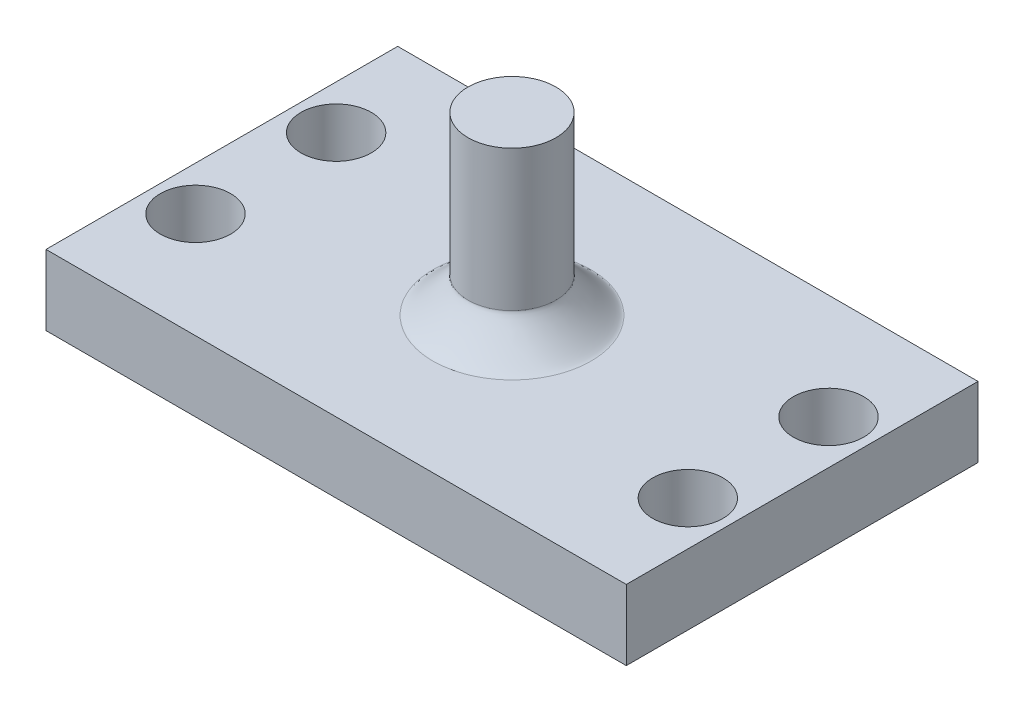
ISO-10303-21;
HEADER;
FILE_DESCRIPTION(('STEP AP214'),'2;1');
FILE_NAME('part.step','',(''),(''),'','','');
FILE_SCHEMA(('AUTOMOTIVE_DESIGN { 1 0 10303 214 1 1 1 1 }'));
ENDSEC;
DATA;
#1=APPLICATION_CONTEXT('core data for automotive mechanical design processes');
#2=APPLICATION_PROTOCOL_DEFINITION('international standard','automotive_design',2000,#1);
#3=PRODUCT_CONTEXT('',#1,'mechanical');
#4=PRODUCT('Part','Part','',(#3));
#5=PRODUCT_RELATED_PRODUCT_CATEGORY('part','',(#4));
#6=PRODUCT_DEFINITION_FORMATION('','',#4);
#7=PRODUCT_DEFINITION_CONTEXT('part definition',#1,'design');
#8=PRODUCT_DEFINITION('design','',#6,#7);
#9=PRODUCT_DEFINITION_SHAPE('','',#8);
#10=(LENGTH_UNIT() NAMED_UNIT(*) SI_UNIT(.MILLI.,.METRE.));
#11=(NAMED_UNIT(*) PLANE_ANGLE_UNIT() SI_UNIT($,.RADIAN.));
#12=(NAMED_UNIT(*) SI_UNIT($,.STERADIAN.) SOLID_ANGLE_UNIT());
#13=UNCERTAINTY_MEASURE_WITH_UNIT(LENGTH_MEASURE(1.E-05),#10,'distance_accuracy_value','');
#14=(GEOMETRIC_REPRESENTATION_CONTEXT(3) GLOBAL_UNCERTAINTY_ASSIGNED_CONTEXT((#13)) GLOBAL_UNIT_ASSIGNED_CONTEXT((#10,
#11,#12)) REPRESENTATION_CONTEXT('',''));
#15=CARTESIAN_POINT('',(0.,0.,0.));
#16=DIRECTION('',(0.,0.,1.));
#17=DIRECTION('',(1.,0.,0.));
#18=AXIS2_PLACEMENT_3D('',#15,#16,#17);
#19=CARTESIAN_POINT('',(-16.5,2.,10.));
#20=DIRECTION('',(1.,0.,0.));
#21=DIRECTION('',(0.,0.,-1.));
#22=AXIS2_PLACEMENT_3D('',#19,#20,#21);
#23=PLANE('',#22);
#24=DIRECTION('',(0.,0.,1.));
#25=VECTOR('',#24,1.);
#26=CARTESIAN_POINT('',(-16.5,-2.,10.));
#27=LINE('',#26,#25);
#28=CARTESIAN_POINT('',(-16.5,-2.,-10.));
#29=VERTEX_POINT('',#28);
#30=CARTESIAN_POINT('',(-16.5,-2.,10.));
#31=VERTEX_POINT('',#30);
#32=EDGE_CURVE('E111',#29,#31,#27,.T.);
#33=ORIENTED_EDGE('',*,*,#32,.T.);
#34=DIRECTION('',(0.,-1.,0.));
#35=VECTOR('',#34,1.);
#36=CARTESIAN_POINT('',(-16.5,2.,10.));
#37=LINE('',#36,#35);
#38=CARTESIAN_POINT('',(-16.5,2.,10.));
#39=VERTEX_POINT('',#38);
#40=EDGE_CURVE('E102',#39,#31,#37,.T.);
#41=ORIENTED_EDGE('',*,*,#40,.F.);
#42=DIRECTION('',(0.,0.,1.));
#43=VECTOR('',#42,1.);
#44=CARTESIAN_POINT('',(-16.5,2.,10.));
#45=LINE('',#44,#43);
#46=CARTESIAN_POINT('',(-16.5,2.,-10.));
#47=VERTEX_POINT('',#46);
#48=EDGE_CURVE('E96',#47,#39,#45,.T.);
#49=ORIENTED_EDGE('',*,*,#48,.F.);
#50=DIRECTION('',(0.,-1.,0.));
#51=VECTOR('',#50,1.);
#52=CARTESIAN_POINT('',(-16.5,2.,-10.));
#53=LINE('',#52,#51);
#54=EDGE_CURVE('E107',#47,#29,#53,.T.);
#55=ORIENTED_EDGE('',*,*,#54,.T.);
#56=EDGE_LOOP('',(#33,#41,#49,#55));
#57=FACE_BOUND('',#56,.T.);
#58=ADVANCED_FACE('F37',(#57),#23,.F.);
#59=CARTESIAN_POINT('',(16.5,2.,10.));
#60=DIRECTION('',(0.,0.,-1.));
#61=DIRECTION('',(-1.,0.,0.));
#62=AXIS2_PLACEMENT_3D('',#59,#60,#61);
#63=PLANE('',#62);
#64=DIRECTION('',(1.,0.,0.));
#65=VECTOR('',#64,1.);
#66=CARTESIAN_POINT('',(16.5,-2.,10.));
#67=LINE('',#66,#65);
#68=CARTESIAN_POINT('',(16.5,-2.,10.));
#69=VERTEX_POINT('',#68);
#70=EDGE_CURVE('E101',#31,#69,#67,.T.);
#71=ORIENTED_EDGE('',*,*,#70,.T.);
#72=DIRECTION('',(0.,-1.,0.));
#73=VECTOR('',#72,1.);
#74=CARTESIAN_POINT('',(16.5,2.,10.));
#75=LINE('',#74,#73);
#76=CARTESIAN_POINT('',(16.5,2.,10.));
#77=VERTEX_POINT('',#76);
#78=EDGE_CURVE('E99',#77,#69,#75,.T.);
#79=ORIENTED_EDGE('',*,*,#78,.F.);
#80=DIRECTION('',(1.,0.,0.));
#81=VECTOR('',#80,1.);
#82=CARTESIAN_POINT('',(16.5,2.,10.));
#83=LINE('',#82,#81);
#84=EDGE_CURVE('E91',#39,#77,#83,.T.);
#85=ORIENTED_EDGE('',*,*,#84,.F.);
#86=ORIENTED_EDGE('',*,*,#40,.T.);
#87=EDGE_LOOP('',(#71,#79,#85,#86));
#88=FACE_BOUND('',#87,.T.);
#89=ADVANCED_FACE('F100',(#88),#63,.F.);
#90=CARTESIAN_POINT('',(16.5,2.,10.));
#91=DIRECTION('',(-1.,0.,0.));
#92=DIRECTION('',(0.,0.,1.));
#93=AXIS2_PLACEMENT_3D('',#90,#91,#92);
#94=PLANE('',#93);
#95=DIRECTION('',(0.,0.,-1.));
#96=VECTOR('',#95,1.);
#97=CARTESIAN_POINT('',(16.5,-2.,10.));
#98=LINE('',#97,#96);
#99=CARTESIAN_POINT('',(16.5,-2.,-10.));
#100=VERTEX_POINT('',#99);
#101=EDGE_CURVE('E77',#69,#100,#98,.T.);
#102=ORIENTED_EDGE('',*,*,#101,.T.);
#103=DIRECTION('',(0.,-1.,0.));
#104=VECTOR('',#103,1.);
#105=CARTESIAN_POINT('',(16.5,2.,-10.));
#106=LINE('',#105,#104);
#107=CARTESIAN_POINT('',(16.5,2.,-10.));
#108=VERTEX_POINT('',#107);
#109=EDGE_CURVE('E103',#108,#100,#106,.T.);
#110=ORIENTED_EDGE('',*,*,#109,.F.);
#111=DIRECTION('',(0.,0.,-1.));
#112=VECTOR('',#111,1.);
#113=CARTESIAN_POINT('',(16.5,2.,10.));
#114=LINE('',#113,#112);
#115=EDGE_CURVE('E94',#77,#108,#114,.T.);
#116=ORIENTED_EDGE('',*,*,#115,.F.);
#117=ORIENTED_EDGE('',*,*,#78,.T.);
#118=EDGE_LOOP('',(#102,#110,#116,#117));
#119=FACE_BOUND('',#118,.T.);
#120=ADVANCED_FACE('F105',(#119),#94,.F.);
#121=CARTESIAN_POINT('',(16.5,2.,-10.));
#122=DIRECTION('',(0.,0.,1.));
#123=DIRECTION('',(1.,0.,0.));
#124=AXIS2_PLACEMENT_3D('',#121,#122,#123);
#125=PLANE('',#124);
#126=DIRECTION('',(-1.,0.,0.));
#127=VECTOR('',#126,1.);
#128=CARTESIAN_POINT('',(16.5,-2.,-10.));
#129=LINE('',#128,#127);
#130=EDGE_CURVE('E83',#100,#29,#129,.T.);
#131=ORIENTED_EDGE('',*,*,#130,.T.);
#132=ORIENTED_EDGE('',*,*,#54,.F.);
#133=DIRECTION('',(-1.,0.,0.));
#134=VECTOR('',#133,1.);
#135=CARTESIAN_POINT('',(16.5,2.,-10.));
#136=LINE('',#135,#134);
#137=EDGE_CURVE('E60',#108,#47,#136,.T.);
#138=ORIENTED_EDGE('',*,*,#137,.F.);
#139=ORIENTED_EDGE('',*,*,#109,.T.);
#140=EDGE_LOOP('',(#131,#132,#138,#139));
#141=FACE_BOUND('',#140,.T.);
#142=ADVANCED_FACE('F161',(#141),#125,.F.);
#143=CARTESIAN_POINT('',(0.,2.,0.));
#144=DIRECTION('',(0.,1.,0.));
#145=DIRECTION('',(0.,0.,1.));
#146=AXIS2_PLACEMENT_3D('',#143,#144,#145);
#147=PLANE('',#146);
#148=CARTESIAN_POINT('',(0.,2.,4.5));
#149=CARTESIAN_POINT('',(0.58904861769985,2.,4.5));
#150=CARTESIAN_POINT('',(1.17786548409582,2.,4.38287704315228));
#151=CARTESIAN_POINT('',(2.26628540718998,2.,3.9320387494493));
#152=CARTESIAN_POINT('',(2.7654602433153,2.,3.59850078736363));
#153=CARTESIAN_POINT('',(3.59850078736363,2.,2.7654602433153));
#154=CARTESIAN_POINT('',(3.9320387494497,2.,2.26628540718993));
#155=CARTESIAN_POINT('',(4.38287704315188,2.,1.17786548409587));
#156=CARTESIAN_POINT('',(4.5,2.,0.58904861769995));
#157=CARTESIAN_POINT('',(4.5,2.,-0.589048617699949));
#158=CARTESIAN_POINT('',(4.38287704315213,2.,-1.17786548409594));
#159=CARTESIAN_POINT('',(3.93203874944945,2.,-2.26628540718987));
#160=CARTESIAN_POINT('',(3.5985007873638,2.,-2.76546024331526));
#161=CARTESIAN_POINT('',(2.76546024331512,2.,-3.59850078736368));
#162=CARTESIAN_POINT('',(2.26628540718997,2.,-3.93203874944941));
#163=CARTESIAN_POINT('',(1.17786548409585,2.,-4.38287704315216));
#164=CARTESIAN_POINT('',(0.58904861769995,2.,-4.5));
#165=CARTESIAN_POINT('',(-0.589048617699949,2.,-4.5));
#166=CARTESIAN_POINT('',(-1.17786548409583,2.,-4.38287704315217));
#167=CARTESIAN_POINT('',(-2.26628540718996,2.,-3.93203874944942));
#168=CARTESIAN_POINT('',(-2.76546024331538,2.,-3.59850078736367));
#169=CARTESIAN_POINT('',(-3.59850078736355,2.,-2.76546024331525));
#170=CARTESIAN_POINT('',(-3.93203874944947,2.,-2.26628540718997));
#171=CARTESIAN_POINT('',(-4.3828770431521,2.,-1.17786548409584));
#172=CARTESIAN_POINT('',(-4.5,2.,-0.589048617699943));
#173=CARTESIAN_POINT('',(-4.5,2.,0.589048617699958));
#174=CARTESIAN_POINT('',(-4.38287704315211,2.,1.17786548409583));
#175=CARTESIAN_POINT('',(-3.93203874944948,2.,2.26628540718996));
#176=CARTESIAN_POINT('',(-3.59850078736362,2.,2.76546024331518));
#177=CARTESIAN_POINT('',(-2.76546024331532,2.,3.59850078736373));
#178=CARTESIAN_POINT('',(-2.26628540719004,2.,3.93203874944947));
#179=CARTESIAN_POINT('',(-1.17786548409578,2.,4.3828770431521));
#180=CARTESIAN_POINT('',(-0.58904861769985,2.,4.5));
#181=CARTESIAN_POINT('',(0.,2.,4.5));
#182=(BOUNDED_CURVE() B_SPLINE_CURVE(3,(#148,#149,#150,#151,#152,#153,#154,#155,#156,#157,#158,
#159,#160,#161,#162,#163,#164,#165,#166,#167,#168,#169,#170,#171,#172,#173,#174,#175,#176,#177,
#178,#179,#180,#181),.UNSPECIFIED.,.T.,.F.) B_SPLINE_CURVE_WITH_KNOTS((4,2,2,2,2,2,2,2,2,2,2,2,
2,2,2,2,4),(0.,0.392699081698724,0.785398163397448,1.17809724509617,1.5707963267949,
1.96349540849362,2.35619449019234,2.74889357189107,3.14159265358979,3.53429173528852,
3.92699081698724,4.31968989868597,4.71238898038469,5.10508806208341,5.49778714378214,
5.89048622548086,6.28318530717959),
.UNSPECIFIED.) CURVE() GEOMETRIC_REPRESENTATION_ITEM() RATIONAL_B_SPLINE_CURVE((1.,1.,1.,1.,1.,
1.,1.,1.,1.,1.,1.,1.,1.,1.,1.,1.,1.,1.,1.,1.,1.,1.,1.,1.,1.,1.,1.,1.,1.,1.,1.,1.,1.,1.)) REPRESENTATION_ITEM(''));
#183=CARTESIAN_POINT('',(0.,2.,4.5));
#184=VERTEX_POINT('',#183);
#185=EDGE_CURVE('E12',#184,#184,#182,.F.);
#186=ORIENTED_EDGE('',*,*,#185,.T.);
#187=EDGE_LOOP('',(#186));
#188=FACE_BOUND('',#187,.T.);
#189=CARTESIAN_POINT('',(14.,2.,-4.));
#190=DIRECTION('',(0.,1.,0.));
#191=DIRECTION('',(0.,0.,-1.));
#192=AXIS2_PLACEMENT_3D('',#189,#190,#191);
#193=CIRCLE('',#192,2.);
#194=CARTESIAN_POINT('',(14.,2.,-6.));
#195=VERTEX_POINT('',#194);
#196=EDGE_CURVE('E187',#195,#195,#193,.T.);
#197=ORIENTED_EDGE('',*,*,#196,.F.);
#198=EDGE_LOOP('',(#197));
#199=FACE_BOUND('',#198,.T.);
#200=CARTESIAN_POINT('',(14.,2.,4.));
#201=DIRECTION('',(0.,1.,0.));
#202=DIRECTION('',(0.,0.,-1.));
#203=AXIS2_PLACEMENT_3D('',#200,#201,#202);
#204=CIRCLE('',#203,2.);
#205=CARTESIAN_POINT('',(14.,2.,2.));
#206=VERTEX_POINT('',#205);
#207=EDGE_CURVE('E191',#206,#206,#204,.T.);
#208=ORIENTED_EDGE('',*,*,#207,.F.);
#209=EDGE_LOOP('',(#208));
#210=FACE_BOUND('',#209,.T.);
#211=CARTESIAN_POINT('',(-14.,2.,4.));
#212=DIRECTION('',(0.,1.,0.));
#213=DIRECTION('',(0.,0.,1.));
#214=AXIS2_PLACEMENT_3D('',#211,#212,#213);
#215=CIRCLE('',#214,2.);
#216=CARTESIAN_POINT('',(-14.,2.,6.));
#217=VERTEX_POINT('',#216);
#218=EDGE_CURVE('E195',#217,#217,#215,.T.);
#219=ORIENTED_EDGE('',*,*,#218,.F.);
#220=EDGE_LOOP('',(#219));
#221=FACE_BOUND('',#220,.T.);
#222=CARTESIAN_POINT('',(-14.,2.,-4.));
#223=DIRECTION('',(0.,1.,0.));
#224=DIRECTION('',(0.,0.,1.));
#225=AXIS2_PLACEMENT_3D('',#222,#223,#224);
#226=CIRCLE('',#225,2.);
#227=CARTESIAN_POINT('',(-14.,2.,-2.));
#228=VERTEX_POINT('',#227);
#229=EDGE_CURVE('E198',#228,#228,#226,.T.);
#230=ORIENTED_EDGE('',*,*,#229,.F.);
#231=EDGE_LOOP('',(#230));
#232=FACE_BOUND('',#231,.T.);
#233=ORIENTED_EDGE('',*,*,#48,.T.);
#234=ORIENTED_EDGE('',*,*,#84,.T.);
#235=ORIENTED_EDGE('',*,*,#115,.T.);
#236=ORIENTED_EDGE('',*,*,#137,.T.);
#237=EDGE_LOOP('',(#233,#234,#235,#236));
#238=FACE_BOUND('',#237,.T.);
#239=ADVANCED_FACE('F92',(#188,#199,#210,#221,#232,#238),#147,.T.);
#240=CARTESIAN_POINT('',(0.,-2.,0.));
#241=DIRECTION('',(0.,1.,0.));
#242=DIRECTION('',(0.,0.,1.));
#243=AXIS2_PLACEMENT_3D('',#240,#241,#242);
#244=PLANE('',#243);
#245=CARTESIAN_POINT('',(14.,-2.,-4.));
#246=DIRECTION('',(0.,1.,0.));
#247=DIRECTION('',(0.,0.,-1.));
#248=AXIS2_PLACEMENT_3D('',#245,#246,#247);
#249=CIRCLE('',#248,2.);
#250=CARTESIAN_POINT('',(14.,-2.,-6.));
#251=VERTEX_POINT('',#250);
#252=EDGE_CURVE('E208',#251,#251,#249,.T.);
#253=ORIENTED_EDGE('',*,*,#252,.T.);
#254=EDGE_LOOP('',(#253));
#255=FACE_BOUND('',#254,.T.);
#256=CARTESIAN_POINT('',(14.,-2.,4.));
#257=DIRECTION('',(0.,1.,0.));
#258=DIRECTION('',(0.,0.,-1.));
#259=AXIS2_PLACEMENT_3D('',#256,#257,#258);
#260=CIRCLE('',#259,2.);
#261=CARTESIAN_POINT('',(14.,-2.,2.));
#262=VERTEX_POINT('',#261);
#263=EDGE_CURVE('E213',#262,#262,#260,.T.);
#264=ORIENTED_EDGE('',*,*,#263,.T.);
#265=EDGE_LOOP('',(#264));
#266=FACE_BOUND('',#265,.T.);
#267=CARTESIAN_POINT('',(-14.,-2.,4.));
#268=DIRECTION('',(0.,1.,0.));
#269=DIRECTION('',(0.,0.,1.));
#270=AXIS2_PLACEMENT_3D('',#267,#268,#269);
#271=CIRCLE('',#270,2.);
#272=CARTESIAN_POINT('',(-14.,-2.,6.));
#273=VERTEX_POINT('',#272);
#274=EDGE_CURVE('E200',#273,#273,#271,.T.);
#275=ORIENTED_EDGE('',*,*,#274,.T.);
#276=EDGE_LOOP('',(#275));
#277=FACE_BOUND('',#276,.T.);
#278=CARTESIAN_POINT('',(-14.,-2.,-4.));
#279=DIRECTION('',(0.,1.,0.));
#280=DIRECTION('',(0.,0.,1.));
#281=AXIS2_PLACEMENT_3D('',#278,#279,#280);
#282=CIRCLE('',#281,2.);
#283=CARTESIAN_POINT('',(-14.,-2.,-2.));
#284=VERTEX_POINT('',#283);
#285=EDGE_CURVE('E114',#284,#284,#282,.T.);
#286=ORIENTED_EDGE('',*,*,#285,.T.);
#287=EDGE_LOOP('',(#286));
#288=FACE_BOUND('',#287,.T.);
#289=ORIENTED_EDGE('',*,*,#32,.F.);
#290=ORIENTED_EDGE('',*,*,#130,.F.);
#291=ORIENTED_EDGE('',*,*,#101,.F.);
#292=ORIENTED_EDGE('',*,*,#70,.F.);
#293=EDGE_LOOP('',(#289,#290,#291,#292));
#294=FACE_BOUND('',#293,.T.);
#295=ADVANCED_FACE('F156',(#255,#266,#277,#288,#294),#244,.F.);
#296=CARTESIAN_POINT('',(-14.,-2.,-4.));
#297=DIRECTION('',(0.,1.,0.));
#298=DIRECTION('',(0.,0.,1.));
#299=AXIS2_PLACEMENT_3D('',#296,#297,#298);
#300=CYLINDRICAL_SURFACE('',#299,2.);
#301=ORIENTED_EDGE('',*,*,#285,.F.);
#302=EDGE_LOOP('',(#301));
#303=FACE_BOUND('',#302,.T.);
#304=ORIENTED_EDGE('',*,*,#229,.T.);
#305=EDGE_LOOP('',(#304));
#306=FACE_BOUND('',#305,.T.);
#307=ADVANCED_FACE('F146',(#303,#306),#300,.F.);
#308=CARTESIAN_POINT('',(-14.,-2.,4.));
#309=DIRECTION('',(0.,1.,0.));
#310=DIRECTION('',(0.,0.,1.));
#311=AXIS2_PLACEMENT_3D('',#308,#309,#310);
#312=CYLINDRICAL_SURFACE('',#311,2.);
#313=ORIENTED_EDGE('',*,*,#274,.F.);
#314=EDGE_LOOP('',(#313));
#315=FACE_BOUND('',#314,.T.);
#316=ORIENTED_EDGE('',*,*,#218,.T.);
#317=EDGE_LOOP('',(#316));
#318=FACE_BOUND('',#317,.T.);
#319=ADVANCED_FACE('F142',(#315,#318),#312,.F.);
#320=CARTESIAN_POINT('',(14.,-2.,4.));
#321=DIRECTION('',(0.,1.,0.));
#322=DIRECTION('',(0.,0.,1.));
#323=AXIS2_PLACEMENT_3D('',#320,#321,#322);
#324=CYLINDRICAL_SURFACE('',#323,2.);
#325=ORIENTED_EDGE('',*,*,#263,.F.);
#326=EDGE_LOOP('',(#325));
#327=FACE_BOUND('',#326,.T.);
#328=ORIENTED_EDGE('',*,*,#207,.T.);
#329=EDGE_LOOP('',(#328));
#330=FACE_BOUND('',#329,.T.);
#331=ADVANCED_FACE('F145',(#327,#330),#324,.F.);
#332=CARTESIAN_POINT('',(14.,-2.,-4.));
#333=DIRECTION('',(0.,1.,0.));
#334=DIRECTION('',(0.,0.,1.));
#335=AXIS2_PLACEMENT_3D('',#332,#333,#334);
#336=CYLINDRICAL_SURFACE('',#335,2.);
#337=ORIENTED_EDGE('',*,*,#252,.F.);
#338=EDGE_LOOP('',(#337));
#339=FACE_BOUND('',#338,.T.);
#340=ORIENTED_EDGE('',*,*,#196,.T.);
#341=EDGE_LOOP('',(#340));
#342=FACE_BOUND('',#341,.T.);
#343=ADVANCED_FACE('F141',(#339,#342),#336,.F.);
#344=CARTESIAN_POINT('',(0.,12.,0.));
#345=DIRECTION('',(0.,-1.,0.));
#346=DIRECTION('',(0.,0.,-1.));
#347=AXIS2_PLACEMENT_3D('',#344,#345,#346);
#348=CYLINDRICAL_SURFACE('',#347,2.5);
#349=CARTESIAN_POINT('',(0.,4.,2.5));
#350=CARTESIAN_POINT('',(-0.327249232055472,4.,2.5));
#351=CARTESIAN_POINT('',(-0.654369713386536,4.,2.43493169064009));
#352=CARTESIAN_POINT('',(-1.25904744843892,4.,2.18446597191634));
#353=CARTESIAN_POINT('',(-1.5363668018418,4.,1.99916710409094));
#354=CARTESIAN_POINT('',(-1.99916710409095,4.,1.53636680184179));
#355=CARTESIAN_POINT('',(-2.18446597191637,4.,1.25904744843886));
#356=CARTESIAN_POINT('',(-2.43493169064007,4.,0.654369713386583));
#357=CARTESIAN_POINT('',(-2.5,4.,0.327249232055532));
#358=CARTESIAN_POINT('',(-2.5,4.,-0.327249232055524));
#359=CARTESIAN_POINT('',(-2.43493169064007,4.,-0.654369713386591));
#360=CARTESIAN_POINT('',(-2.18446597191637,4.,-1.25904744843886));
#361=CARTESIAN_POINT('',(-1.99916710409093,4.,-1.53636680184181));
#362=CARTESIAN_POINT('',(-1.53636680184181,4.,-1.99916710409093));
#363=CARTESIAN_POINT('',(-1.25904744843886,4.,-2.18446597191637));
#364=CARTESIAN_POINT('',(-0.65436971338658,4.,-2.43493169064007));
#365=CARTESIAN_POINT('',(-0.327249232055527,4.,-2.5));
#366=CARTESIAN_POINT('',(0.327249232055528,4.,-2.5));
#367=CARTESIAN_POINT('',(0.654369713386587,4.,-2.43493169064007));
#368=CARTESIAN_POINT('',(1.25904744843887,4.,-2.18446597191637));
#369=CARTESIAN_POINT('',(1.53636680184174,4.,-1.999167104091));
#370=CARTESIAN_POINT('',(1.99916710409099,4.,-1.53636680184174));
#371=CARTESIAN_POINT('',(2.1844659719164,4.,-1.2590474484388));
#372=CARTESIAN_POINT('',(2.43493169064004,4.,-0.654369713386654));
#373=CARTESIAN_POINT('',(2.5,4.,-0.327249232055527));
#374=CARTESIAN_POINT('',(2.5,4.,0.327249232055528));
#375=CARTESIAN_POINT('',(2.43493169064005,4.,0.654369713386634));
#376=CARTESIAN_POINT('',(2.18446597191639,4.,1.25904744843881));
#377=CARTESIAN_POINT('',(1.99916710409092,4.,1.53636680184182));
#378=CARTESIAN_POINT('',(1.53636680184182,4.,1.99916710409092));
#379=CARTESIAN_POINT('',(1.25904744843891,4.,2.18446597191635));
#380=CARTESIAN_POINT('',(0.654369713386541,4.,2.43493169064008));
#381=CARTESIAN_POINT('',(0.327249232055472,4.,2.5));
#382=CARTESIAN_POINT('',(0.,4.,2.5));
#383=(BOUNDED_CURVE() B_SPLINE_CURVE(3,(#349,#350,#351,#352,#353,#354,#355,#356,#357,#358,#359,
#360,#361,#362,#363,#364,#365,#366,#367,#368,#369,#370,#371,#372,#373,#374,#375,#376,#377,#378,
#379,#380,#381,#382),.UNSPECIFIED.,.T.,.F.) B_SPLINE_CURVE_WITH_KNOTS((4,2,2,2,2,2,2,2,2,2,2,2,
2,2,2,2,4),(0.,0.392699081698725,0.785398163397448,1.17809724509617,1.5707963267949,
1.96349540849362,2.35619449019234,2.74889357189107,3.14159265358979,3.53429173528852,
3.92699081698724,4.31968989868597,4.71238898038469,5.10508806208341,5.49778714378214,
5.89048622548086,6.28318530717959),
.UNSPECIFIED.) CURVE() GEOMETRIC_REPRESENTATION_ITEM() RATIONAL_B_SPLINE_CURVE((1.,1.,1.,1.,1.,
1.,1.,1.,1.,1.,1.,1.,1.,1.,1.,1.,1.,1.,1.,1.,1.,1.,1.,1.,1.,1.,1.,1.,1.,1.,1.,1.,1.,1.)) REPRESENTATION_ITEM(''));
#384=CARTESIAN_POINT('',(0.,4.,2.5));
#385=VERTEX_POINT('',#384);
#386=EDGE_CURVE('E52',#385,#385,#383,.F.);
#387=ORIENTED_EDGE('',*,*,#386,.T.);
#388=EDGE_LOOP('',(#387));
#389=FACE_BOUND('',#388,.T.);
#390=CARTESIAN_POINT('',(0.,12.,0.));
#391=DIRECTION('',(0.,1.,0.));
#392=DIRECTION('',(0.,0.,1.));
#393=AXIS2_PLACEMENT_3D('',#390,#391,#392);
#394=CIRCLE('',#393,2.5);
#395=CARTESIAN_POINT('',(0.,12.,2.5));
#396=VERTEX_POINT('',#395);
#397=EDGE_CURVE('E209',#396,#396,#394,.T.);
#398=ORIENTED_EDGE('',*,*,#397,.F.);
#399=EDGE_LOOP('',(#398));
#400=FACE_BOUND('',#399,.T.);
#401=ADVANCED_FACE('F130',(#389,#400),#348,.T.);
#402=CARTESIAN_POINT('',(0.,12.,0.));
#403=DIRECTION('',(0.,1.,0.));
#404=DIRECTION('',(0.,0.,1.));
#405=AXIS2_PLACEMENT_3D('',#402,#403,#404);
#406=PLANE('',#405);
#407=ORIENTED_EDGE('',*,*,#397,.T.);
#408=EDGE_LOOP('',(#407));
#409=FACE_BOUND('',#408,.T.);
#410=ADVANCED_FACE('F140',(#409),#406,.T.);
#411=CARTESIAN_POINT('',(0.,4.,2.5));
#412=CARTESIAN_POINT('',(0.327249232055472,4.,2.5));
#413=CARTESIAN_POINT('',(0.654369713386541,4.,2.43493169064008));
#414=CARTESIAN_POINT('',(1.25904744843891,4.,2.18446597191635));
#415=CARTESIAN_POINT('',(1.53636680184182,4.,1.99916710409092));
#416=CARTESIAN_POINT('',(1.99916710409092,4.,1.53636680184182));
#417=CARTESIAN_POINT('',(2.18446597191639,4.,1.25904744843881));
#418=CARTESIAN_POINT('',(2.43493169064005,4.,0.654369713386634));
#419=CARTESIAN_POINT('',(2.5,4.,0.327249232055528));
#420=CARTESIAN_POINT('',(2.5,4.,-0.327249232055527));
#421=CARTESIAN_POINT('',(2.43493169064004,4.,-0.654369713386654));
#422=CARTESIAN_POINT('',(2.1844659719164,4.,-1.2590474484388));
#423=CARTESIAN_POINT('',(1.99916710409099,4.,-1.53636680184174));
#424=CARTESIAN_POINT('',(1.53636680184174,4.,-1.999167104091));
#425=CARTESIAN_POINT('',(1.25904744843887,4.,-2.18446597191637));
#426=CARTESIAN_POINT('',(0.654369713386587,4.,-2.43493169064007));
#427=CARTESIAN_POINT('',(0.327249232055528,4.,-2.5));
#428=CARTESIAN_POINT('',(-0.327249232055527,4.,-2.5));
#429=CARTESIAN_POINT('',(-0.65436971338658,4.,-2.43493169064007));
#430=CARTESIAN_POINT('',(-1.25904744843886,4.,-2.18446597191637));
#431=CARTESIAN_POINT('',(-1.53636680184181,4.,-1.99916710409093));
#432=CARTESIAN_POINT('',(-1.99916710409093,4.,-1.53636680184181));
#433=CARTESIAN_POINT('',(-2.18446597191637,4.,-1.25904744843886));
#434=CARTESIAN_POINT('',(-2.43493169064007,4.,-0.654369713386591));
#435=CARTESIAN_POINT('',(-2.5,4.,-0.327249232055524));
#436=CARTESIAN_POINT('',(-2.5,4.,0.327249232055532));
#437=CARTESIAN_POINT('',(-2.43493169064007,4.,0.654369713386583));
#438=CARTESIAN_POINT('',(-2.18446597191637,4.,1.25904744843886));
#439=CARTESIAN_POINT('',(-1.99916710409095,4.,1.53636680184179));
#440=CARTESIAN_POINT('',(-1.5363668018418,4.,1.99916710409094));
#441=CARTESIAN_POINT('',(-1.25904744843892,4.,2.18446597191634));
#442=CARTESIAN_POINT('',(-0.654369713386536,4.,2.43493169064009));
#443=CARTESIAN_POINT('',(-0.327249232055472,4.,2.5));
#444=CARTESIAN_POINT('',(0.,4.,2.5));
#445=CARTESIAN_POINT('',(0.,2.,2.5));
#446=CARTESIAN_POINT('',(0.327249232055472,2.,2.5));
#447=CARTESIAN_POINT('',(0.654369713386495,2.,2.43493169064013));
#448=CARTESIAN_POINT('',(1.25904744843895,2.,2.18446597191631));
#449=CARTESIAN_POINT('',(1.53636680184163,2.,1.99916710409111));
#450=CARTESIAN_POINT('',(1.99916710409111,2.,1.53636680184163));
#451=CARTESIAN_POINT('',(2.18446597191676,2.,1.25904744843894));
#452=CARTESIAN_POINT('',(2.43493169063968,2.,0.654369713386502));
#453=CARTESIAN_POINT('',(2.5,2.,0.327249232055528));
#454=CARTESIAN_POINT('',(2.5,2.,-0.327249232055527));
#455=CARTESIAN_POINT('',(2.43493169063993,2.,-0.654369713386696));
#456=CARTESIAN_POINT('',(2.1844659719165,2.,-1.25904744843876));
#457=CARTESIAN_POINT('',(1.99916710409099,2.00000000000013,-1.53636680184187));
#458=CARTESIAN_POINT('',(1.53636680184174,1.99999999999987,-1.99916710409087));
#459=CARTESIAN_POINT('',(1.25904744843897,2.,-2.1844659719165));
#460=CARTESIAN_POINT('',(0.654369713386489,2.,-2.43493169063994));
#461=CARTESIAN_POINT('',(0.327249232055528,2.,-2.5));
#462=CARTESIAN_POINT('',(-0.327249232055527,2.,-2.5));
#463=CARTESIAN_POINT('',(-0.65436971338661,2.,-2.43493169064019));
#464=CARTESIAN_POINT('',(-1.25904744843883,2.,-2.18446597191624));
#465=CARTESIAN_POINT('',(-1.53636680184181,2.,-1.99916710409093));
#466=CARTESIAN_POINT('',(-1.99916710409093,2.,-1.53636680184181));
#467=CARTESIAN_POINT('',(-2.1844659719165,2.,-1.25904744843887));
#468=CARTESIAN_POINT('',(-2.43493169063993,2.,-0.654369713386587));
#469=CARTESIAN_POINT('',(-2.5,2.,-0.327249232055524));
#470=CARTESIAN_POINT('',(-2.5,2.,0.327249232055532));
#471=CARTESIAN_POINT('',(-2.43493169064006,2.,0.654369713386676));
#472=CARTESIAN_POINT('',(-2.18446597191638,2.,1.25904744843877));
#473=CARTESIAN_POINT('',(-1.99916710409102,2.,1.53636680184179));
#474=CARTESIAN_POINT('',(-1.53636680184173,2.,1.99916710409094));
#475=CARTESIAN_POINT('',(-1.259047448439,2.,2.1844659719165));
#476=CARTESIAN_POINT('',(-0.65436971338646,2.,2.43493169063993));
#477=CARTESIAN_POINT('',(-0.327249232055472,2.,2.5));
#478=CARTESIAN_POINT('',(0.,2.,2.5));
#479=CARTESIAN_POINT('',(0.,2.,4.5));
#480=CARTESIAN_POINT('',(0.58904861769985,2.,4.5));
#481=CARTESIAN_POINT('',(1.17786548409582,2.,4.38287704315228));
#482=CARTESIAN_POINT('',(2.26628540718998,2.,3.9320387494493));
#483=CARTESIAN_POINT('',(2.7654602433153,2.,3.59850078736363));
#484=CARTESIAN_POINT('',(3.59850078736363,2.,2.7654602433153));
#485=CARTESIAN_POINT('',(3.9320387494497,2.,2.26628540718993));
#486=CARTESIAN_POINT('',(4.38287704315188,2.,1.17786548409587));
#487=CARTESIAN_POINT('',(4.5,2.,0.58904861769995));
#488=CARTESIAN_POINT('',(4.5,2.,-0.589048617699949));
#489=CARTESIAN_POINT('',(4.38287704315213,2.,-1.17786548409594));
#490=CARTESIAN_POINT('',(3.93203874944945,2.,-2.26628540718987));
#491=CARTESIAN_POINT('',(3.5985007873638,2.,-2.76546024331526));
#492=CARTESIAN_POINT('',(2.76546024331512,2.,-3.59850078736368));
#493=CARTESIAN_POINT('',(2.26628540718997,2.,-3.93203874944941));
#494=CARTESIAN_POINT('',(1.17786548409585,2.,-4.38287704315216));
#495=CARTESIAN_POINT('',(0.58904861769995,2.,-4.5));
#496=CARTESIAN_POINT('',(-0.589048617699949,2.,-4.5));
#497=CARTESIAN_POINT('',(-1.17786548409583,2.,-4.38287704315217));
#498=CARTESIAN_POINT('',(-2.26628540718996,2.,-3.93203874944942));
#499=CARTESIAN_POINT('',(-2.76546024331538,2.,-3.59850078736367));
#500=CARTESIAN_POINT('',(-3.59850078736355,2.,-2.76546024331525));
#501=CARTESIAN_POINT('',(-3.93203874944947,2.,-2.26628540718997));
#502=CARTESIAN_POINT('',(-4.3828770431521,2.,-1.17786548409584));
#503=CARTESIAN_POINT('',(-4.5,2.,-0.589048617699943));
#504=CARTESIAN_POINT('',(-4.5,2.,0.589048617699958));
#505=CARTESIAN_POINT('',(-4.38287704315211,2.,1.17786548409583));
#506=CARTESIAN_POINT('',(-3.93203874944948,2.,2.26628540718996));
#507=CARTESIAN_POINT('',(-3.59850078736362,2.,2.76546024331518));
#508=CARTESIAN_POINT('',(-2.76546024331532,2.,3.59850078736373));
#509=CARTESIAN_POINT('',(-2.26628540719004,2.,3.93203874944947));
#510=CARTESIAN_POINT('',(-1.17786548409578,2.,4.3828770431521));
#511=CARTESIAN_POINT('',(-0.58904861769985,2.,4.5));
#512=CARTESIAN_POINT('',(0.,2.,4.5));
#513=(BOUNDED_SURFACE() B_SPLINE_SURFACE(2,3,((#411,#412,#413,#414,#415,#416,#417,#418,#419,
#420,#421,#422,#423,#424,#425,#426,#427,#428,#429,#430,#431,#432,#433,#434,#435,#436,#437,#438,
#439,#440,#441,#442,#443,#444),(#445,#446,#447,#448,#449,#450,#451,#452,#453,#454,#455,#456,
#457,#458,#459,#460,#461,#462,#463,#464,#465,#466,#467,#468,#469,#470,#471,#472,#473,#474,#475,
#476,#477,#478),(#479,#480,#481,#482,#483,#484,#485,#486,#487,#488,#489,#490,#491,#492,#493,
#494,#495,#496,#497,#498,#499,#500,#501,#502,#503,#504,#505,#506,#507,#508,#509,#510,#511,
#512)),.UNSPECIFIED.,.F.,.T.,.F.) B_SPLINE_SURFACE_WITH_KNOTS((3,3),(4,2,2,2,2,2,2,2,2,2,2,2,2,
2,2,2,4),(0.,1.),(0.,0.392699081698724,0.785398163397448,1.17809724509617,1.5707963267949,
1.96349540849362,2.35619449019234,2.74889357189107,3.14159265358979,3.53429173528852,
3.92699081698724,4.31968989868597,4.71238898038469,5.10508806208341,5.49778714378214,
5.89048622548086,6.28318530717959),
.UNSPECIFIED.) GEOMETRIC_REPRESENTATION_ITEM() RATIONAL_B_SPLINE_SURFACE(((1.,1.,1.,1.,1.,1.,1.,
1.,1.,1.,1.,1.,1.,1.,1.,1.,1.,1.,1.,1.,1.,1.,1.,1.,1.,1.,1.,1.,1.,1.,1.,1.,1.,1.),
(0.14142135623731,0.14142135623731,0.14142135623731,0.14142135623731,0.14142135623731,
0.14142135623731,0.14142135623731,0.14142135623731,0.14142135623731,0.14142135623731,
0.14142135623731,0.14142135623731,0.14142135623731,0.14142135623731,0.14142135623731,
0.14142135623731,0.14142135623731,0.14142135623731,0.14142135623731,0.14142135623731,
0.14142135623731,0.14142135623731,0.14142135623731,0.14142135623731,0.14142135623731,
0.14142135623731,0.14142135623731,0.14142135623731,0.14142135623731,0.14142135623731,
0.14142135623731,0.14142135623731,0.14142135623731,0.14142135623731),(1.,1.,1.,1.,1.,1.,1.,1.,
1.,1.,1.,1.,1.,1.,1.,1.,1.,1.,1.,1.,1.,1.,1.,1.,1.,1.,1.,1.,1.,1.,1.,1.,1.,1.))) REPRESENTATION_ITEM('') SURFACE());
#514=ORIENTED_EDGE('',*,*,#185,.F.);
#515=EDGE_LOOP('',(#514));
#516=FACE_BOUND('',#515,.T.);
#517=ORIENTED_EDGE('',*,*,#386,.F.);
#518=EDGE_LOOP('',(#517));
#519=FACE_BOUND('',#518,.T.);
#520=ADVANCED_FACE('F40',(#516,#519),#513,.T.);
#521=CLOSED_SHELL('',(#58,#89,#120,#142,#239,#295,#307,#319,#331,#343,#401,#410,#520));
#522=MANIFOLD_SOLID_BREP('B2',#521);
#523=ADVANCED_BREP_SHAPE_REPRESENTATION('',(#18,#522),#14);
#524=SHAPE_DEFINITION_REPRESENTATION(#9,#523);
ENDSEC;
END-ISO-10303-21;
